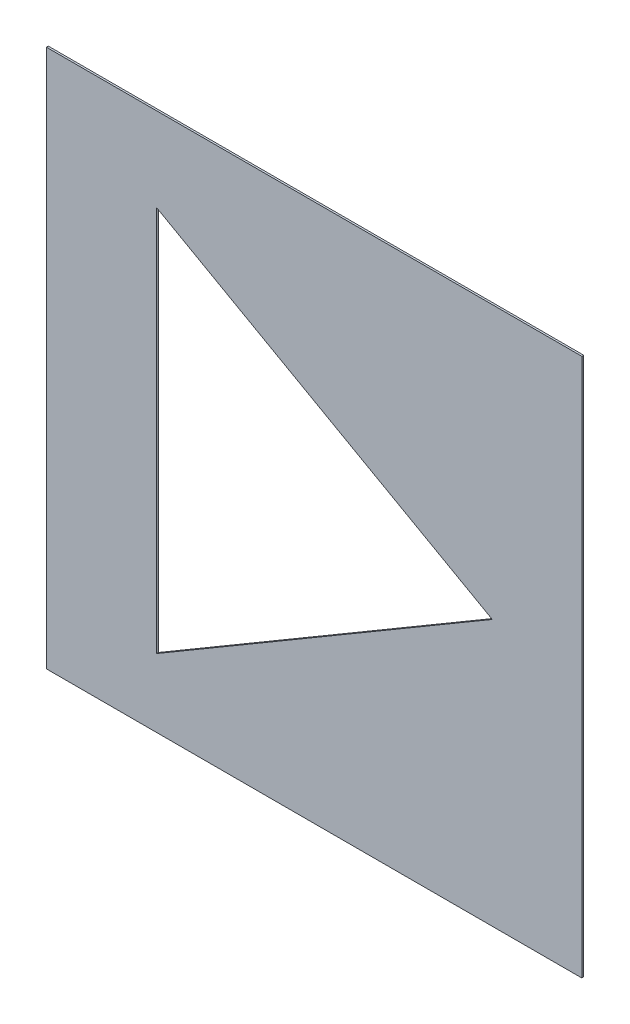
ISO-10303-21;
HEADER;
FILE_DESCRIPTION(('STEP AP214'),'2;1');
FILE_NAME('part.step','',(''),(''),'','','');
FILE_SCHEMA(('AUTOMOTIVE_DESIGN { 1 0 10303 214 1 1 1 1 }'));
ENDSEC;
DATA;
#1=APPLICATION_CONTEXT('core data for automotive mechanical design processes');
#2=APPLICATION_PROTOCOL_DEFINITION('international standard','automotive_design',2000,#1);
#3=PRODUCT_CONTEXT('',#1,'mechanical');
#4=PRODUCT('Part','Part','',(#3));
#5=PRODUCT_RELATED_PRODUCT_CATEGORY('part','',(#4));
#6=PRODUCT_DEFINITION_FORMATION('','',#4);
#7=PRODUCT_DEFINITION_CONTEXT('part definition',#1,'design');
#8=PRODUCT_DEFINITION('design','',#6,#7);
#9=PRODUCT_DEFINITION_SHAPE('','',#8);
#10=(LENGTH_UNIT() NAMED_UNIT(*) SI_UNIT(.MILLI.,.METRE.));
#11=(NAMED_UNIT(*) PLANE_ANGLE_UNIT() SI_UNIT($,.RADIAN.));
#12=(NAMED_UNIT(*) SI_UNIT($,.STERADIAN.) SOLID_ANGLE_UNIT());
#13=UNCERTAINTY_MEASURE_WITH_UNIT(LENGTH_MEASURE(1.E-05),#10,'distance_accuracy_value','');
#14=(GEOMETRIC_REPRESENTATION_CONTEXT(3) GLOBAL_UNCERTAINTY_ASSIGNED_CONTEXT((#13)) GLOBAL_UNIT_ASSIGNED_CONTEXT((#10,
#11,#12)) REPRESENTATION_CONTEXT('',''));
#15=CARTESIAN_POINT('',(0.,0.,0.));
#16=DIRECTION('',(0.,0.,1.));
#17=DIRECTION('',(1.,0.,0.));
#18=AXIS2_PLACEMENT_3D('',#15,#16,#17);
#19=CARTESIAN_POINT('',(-1.0634775795535,0.1814466251262,0.00086146168299));
#20=DIRECTION('',(0.,1.,0.));
#21=DIRECTION('',(0.,0.,1.));
#22=AXIS2_PLACEMENT_3D('',#19,#20,#21);
#23=PLANE('',#22);
#24=DIRECTION('',(0.,0.,1.));
#25=VECTOR('',#24,1.);
#26=CARTESIAN_POINT('',(-1.2323100649185,0.1814466251262,-0.00033853831701));
#27=LINE('',#26,#25);
#28=CARTESIAN_POINT('',(-1.2323100649185,0.1814466251262,-0.00033853831701));
#29=VERTEX_POINT('',#28);
#30=CARTESIAN_POINT('',(-1.2323100649185,0.1814466251262,0.00086146168299));
#31=VERTEX_POINT('',#30);
#32=EDGE_CURVE('E11',#29,#31,#27,.T.);
#33=ORIENTED_EDGE('',*,*,#32,.T.);
#34=DIRECTION('',(1.,0.,0.));
#35=VECTOR('',#34,1.);
#36=CARTESIAN_POINT('',(-1.2323100649185,0.1814466251262,0.00086146168299));
#37=LINE('',#36,#35);
#38=CARTESIAN_POINT('',(-0.8946450941885,0.1814466251262,0.00086146168299));
#39=VERTEX_POINT('',#38);
#40=EDGE_CURVE('E24',#31,#39,#37,.T.);
#41=ORIENTED_EDGE('',*,*,#40,.T.);
#42=DIRECTION('',(0.,0.,1.));
#43=VECTOR('',#42,1.);
#44=CARTESIAN_POINT('',(-0.8946450941885,0.1814466251262,-0.00033853831701));
#45=LINE('',#44,#43);
#46=CARTESIAN_POINT('',(-0.8946450941885,0.1814466251262,-0.00033853831701));
#47=VERTEX_POINT('',#46);
#48=EDGE_CURVE('E129',#47,#39,#45,.T.);
#49=ORIENTED_EDGE('',*,*,#48,.F.);
#50=DIRECTION('',(1.,0.,0.));
#51=VECTOR('',#50,1.);
#52=CARTESIAN_POINT('',(-1.2323100649185,0.1814466251262,-0.00033853831701));
#53=LINE('',#52,#51);
#54=EDGE_CURVE('E126',#29,#47,#53,.T.);
#55=ORIENTED_EDGE('',*,*,#54,.F.);
#56=EDGE_LOOP('',(#33,#41,#49,#55));
#57=FACE_BOUND('',#56,.T.);
#58=ADVANCED_FACE('F17',(#57),#23,.T.);
#59=CARTESIAN_POINT('',(-0.8946450941885,0.011705812303,0.00086146168299));
#60=DIRECTION('',(1.,0.,0.));
#61=DIRECTION('',(0.,0.,-1.));
#62=AXIS2_PLACEMENT_3D('',#59,#60,#61);
#63=PLANE('',#62);
#64=ORIENTED_EDGE('',*,*,#48,.T.);
#65=DIRECTION('',(0.,-1.,0.));
#66=VECTOR('',#65,1.);
#67=CARTESIAN_POINT('',(-0.8946450941885,0.1814466251262,0.00086146168299));
#68=LINE('',#67,#66);
#69=CARTESIAN_POINT('',(-0.8946450941885,-0.1580350005202,0.00086146168299));
#70=VERTEX_POINT('',#69);
#71=EDGE_CURVE('E124',#39,#70,#68,.T.);
#72=ORIENTED_EDGE('',*,*,#71,.T.);
#73=DIRECTION('',(0.,0.,1.));
#74=VECTOR('',#73,1.);
#75=CARTESIAN_POINT('',(-0.8946450941885,-0.1580350005202,-0.00033853831701));
#76=LINE('',#75,#74);
#77=CARTESIAN_POINT('',(-0.8946450941885,-0.1580350005202,-0.00033853831701));
#78=VERTEX_POINT('',#77);
#79=EDGE_CURVE('E121',#78,#70,#76,.T.);
#80=ORIENTED_EDGE('',*,*,#79,.F.);
#81=DIRECTION('',(0.,-1.,0.));
#82=VECTOR('',#81,1.);
#83=CARTESIAN_POINT('',(-0.8946450941885,0.1814466251262,-0.00033853831701));
#84=LINE('',#83,#82);
#85=EDGE_CURVE('E118',#47,#78,#84,.T.);
#86=ORIENTED_EDGE('',*,*,#85,.F.);
#87=EDGE_LOOP('',(#64,#72,#80,#86));
#88=FACE_BOUND('',#87,.T.);
#89=ADVANCED_FACE('F136',(#88),#63,.T.);
#90=CARTESIAN_POINT('',(-1.0634775795535,-0.1580350005202,0.00086146168299));
#91=DIRECTION('',(0.,-1.,0.));
#92=DIRECTION('',(0.,0.,-1.));
#93=AXIS2_PLACEMENT_3D('',#90,#91,#92);
#94=PLANE('',#93);
#95=ORIENTED_EDGE('',*,*,#79,.T.);
#96=DIRECTION('',(-1.,0.,0.));
#97=VECTOR('',#96,1.);
#98=CARTESIAN_POINT('',(-0.8946450941885,-0.1580350005202,0.00086146168299));
#99=LINE('',#98,#97);
#100=CARTESIAN_POINT('',(-1.2323100649185,-0.1580350005202,0.00086146168299));
#101=VERTEX_POINT('',#100);
#102=EDGE_CURVE('E116',#70,#101,#99,.T.);
#103=ORIENTED_EDGE('',*,*,#102,.T.);
#104=DIRECTION('',(0.,0.,1.));
#105=VECTOR('',#104,1.);
#106=CARTESIAN_POINT('',(-1.2323100649185,-0.1580350005202,-0.00033853831701));
#107=LINE('',#106,#105);
#108=CARTESIAN_POINT('',(-1.2323100649185,-0.1580350005202,-0.00033853831701));
#109=VERTEX_POINT('',#108);
#110=EDGE_CURVE('E113',#109,#101,#107,.T.);
#111=ORIENTED_EDGE('',*,*,#110,.F.);
#112=DIRECTION('',(-1.,0.,0.));
#113=VECTOR('',#112,1.);
#114=CARTESIAN_POINT('',(-0.8946450941885,-0.1580350005202,-0.00033853831701));
#115=LINE('',#114,#113);
#116=EDGE_CURVE('E110',#78,#109,#115,.T.);
#117=ORIENTED_EDGE('',*,*,#116,.F.);
#118=EDGE_LOOP('',(#95,#103,#111,#117));
#119=FACE_BOUND('',#118,.T.);
#120=ADVANCED_FACE('F141',(#119),#94,.T.);
#121=CARTESIAN_POINT('',(-1.2323100649185,0.011705812303,0.00086146168299));
#122=DIRECTION('',(-1.,0.,0.));
#123=DIRECTION('',(0.,0.,1.));
#124=AXIS2_PLACEMENT_3D('',#121,#122,#123);
#125=PLANE('',#124);
#126=ORIENTED_EDGE('',*,*,#110,.T.);
#127=DIRECTION('',(0.,1.,0.));
#128=VECTOR('',#127,1.);
#129=CARTESIAN_POINT('',(-1.2323100649185,-0.1580350005202,0.00086146168299));
#130=LINE('',#129,#128);
#131=EDGE_CURVE('E108',#101,#31,#130,.T.);
#132=ORIENTED_EDGE('',*,*,#131,.T.);
#133=ORIENTED_EDGE('',*,*,#32,.F.);
#134=DIRECTION('',(0.,1.,0.));
#135=VECTOR('',#134,1.);
#136=CARTESIAN_POINT('',(-1.2323100649185,-0.1580350005202,-0.00033853831701));
#137=LINE('',#136,#135);
#138=EDGE_CURVE('E105',#109,#29,#137,.T.);
#139=ORIENTED_EDGE('',*,*,#138,.F.);
#140=EDGE_LOOP('',(#126,#132,#133,#139));
#141=FACE_BOUND('',#140,.T.);
#142=ADVANCED_FACE('F143',(#141),#125,.T.);
#143=CARTESIAN_POINT('',(-1.1628156233065,0.0068178138476,0.00086146168299));
#144=DIRECTION('',(1.,0.,0.));
#145=DIRECTION('',(0.,0.,-1.));
#146=AXIS2_PLACEMENT_3D('',#143,#144,#145);
#147=PLANE('',#146);
#148=DIRECTION('',(0.,0.,1.));
#149=VECTOR('',#148,1.);
#150=CARTESIAN_POINT('',(-1.1628156233065,0.1286008991586,-0.00033853831701));
#151=LINE('',#150,#149);
#152=CARTESIAN_POINT('',(-1.1628156233065,0.1286008991586,-0.00033853831701));
#153=VERTEX_POINT('',#152);
#154=CARTESIAN_POINT('',(-1.1628156233065,0.1286008991586,0.00086146168299));
#155=VERTEX_POINT('',#154);
#156=EDGE_CURVE('E94',#153,#155,#151,.T.);
#157=ORIENTED_EDGE('',*,*,#156,.T.);
#158=DIRECTION('',(0.,-1.,0.));
#159=VECTOR('',#158,1.);
#160=CARTESIAN_POINT('',(-1.1628156233065,0.1286008991586,0.00086146168299));
#161=LINE('',#160,#159);
#162=CARTESIAN_POINT('',(-1.1628156233065,-0.1149652714634,0.00086146168299));
#163=VERTEX_POINT('',#162);
#164=EDGE_CURVE('E102',#155,#163,#161,.T.);
#165=ORIENTED_EDGE('',*,*,#164,.T.);
#166=DIRECTION('',(0.,0.,1.));
#167=VECTOR('',#166,1.);
#168=CARTESIAN_POINT('',(-1.1628156233065,-0.1149652714634,-0.00033853831701));
#169=LINE('',#168,#167);
#170=CARTESIAN_POINT('',(-1.1628156233065,-0.1149652714634,-0.00033853831701));
#171=VERTEX_POINT('',#170);
#172=EDGE_CURVE('E100',#171,#163,#169,.T.);
#173=ORIENTED_EDGE('',*,*,#172,.F.);
#174=DIRECTION('',(0.,-1.,0.));
#175=VECTOR('',#174,1.);
#176=CARTESIAN_POINT('',(-1.1628156233065,0.1286008991586,-0.00033853831701));
#177=LINE('',#176,#175);
#178=EDGE_CURVE('E90',#153,#171,#177,.T.);
#179=ORIENTED_EDGE('',*,*,#178,.F.);
#180=EDGE_LOOP('',(#157,#165,#173,#179));
#181=FACE_BOUND('',#180,.T.);
#182=ADVANCED_FACE('F165',(#181),#147,.T.);
#183=CARTESIAN_POINT('',(-1.0569554702197,-0.0527185203085346,0.00086146168299));
#184=DIRECTION('',(-0.506875367812853,0.862019351003552,0.));
#185=DIRECTION('',(0.,0.,1.));
#186=AXIS2_PLACEMENT_3D('',#183,#184,#185);
#187=PLANE('',#186);
#188=ORIENTED_EDGE('',*,*,#172,.T.);
#189=DIRECTION('',(0.862019351003552,0.506875367812853,0.));
#190=VECTOR('',#189,1.);
#191=CARTESIAN_POINT('',(-1.1628156233065,-0.1149652714634,0.00086146168299));
#192=LINE('',#191,#190);
#193=CARTESIAN_POINT('',(-0.9510953171329,0.00952823084633079,0.00086146168299));
#194=VERTEX_POINT('',#193);
#195=EDGE_CURVE('E78',#163,#194,#192,.T.);
#196=ORIENTED_EDGE('',*,*,#195,.T.);
#197=DIRECTION('',(0.,0.,1.));
#198=VECTOR('',#197,1.);
#199=CARTESIAN_POINT('',(-0.9510953171329,0.00952823084633079,-0.00033853831701));
#200=LINE('',#199,#198);
#201=CARTESIAN_POINT('',(-0.9510953171329,0.00952823084633079,-0.00033853831701));
#202=VERTEX_POINT('',#201);
#203=EDGE_CURVE('E72',#202,#194,#200,.T.);
#204=ORIENTED_EDGE('',*,*,#203,.F.);
#205=DIRECTION('',(0.862019351003552,0.506875367812853,0.));
#206=VECTOR('',#205,1.);
#207=CARTESIAN_POINT('',(-1.1628156233065,-0.1149652714634,-0.00033853831701));
#208=LINE('',#207,#206);
#209=EDGE_CURVE('E76',#171,#202,#208,.T.);
#210=ORIENTED_EDGE('',*,*,#209,.F.);
#211=EDGE_LOOP('',(#188,#196,#204,#210));
#212=FACE_BOUND('',#211,.T.);
#213=ADVANCED_FACE('F75',(#212),#187,.T.);
#214=CARTESIAN_POINT('',(-1.0569554702197,0.0690645650024654,0.00086146168299));
#215=DIRECTION('',(-0.490198680058478,-0.871610723929511,0.));
#216=DIRECTION('',(0.,0.,-1.));
#217=AXIS2_PLACEMENT_3D('',#214,#215,#216);
#218=PLANE('',#217);
#219=ORIENTED_EDGE('',*,*,#203,.T.);
#220=DIRECTION('',(-0.871610723929511,0.490198680058478,0.));
#221=VECTOR('',#220,1.);
#222=CARTESIAN_POINT('',(-0.9510953171329,0.00952823084633079,0.00086146168299));
#223=LINE('',#222,#221);
#224=EDGE_CURVE('E91',#194,#155,#223,.T.);
#225=ORIENTED_EDGE('',*,*,#224,.T.);
#226=ORIENTED_EDGE('',*,*,#156,.F.);
#227=DIRECTION('',(-0.871610723929511,0.490198680058478,0.));
#228=VECTOR('',#227,1.);
#229=CARTESIAN_POINT('',(-0.9510953171329,0.00952823084633079,-0.00033853831701));
#230=LINE('',#229,#228);
#231=EDGE_CURVE('E88',#202,#153,#230,.T.);
#232=ORIENTED_EDGE('',*,*,#231,.F.);
#233=EDGE_LOOP('',(#219,#225,#226,#232));
#234=FACE_BOUND('',#233,.T.);
#235=ADVANCED_FACE('F93',(#234),#218,.T.);
#236=CARTESIAN_POINT('',(-1.0634775795535,-0.1580350005202,-0.00033853831701));
#237=DIRECTION('',(0.,0.,1.));
#238=DIRECTION('',(1.,0.,0.));
#239=AXIS2_PLACEMENT_3D('',#236,#237,#238);
#240=PLANE('',#239);
#241=ORIENTED_EDGE('',*,*,#54,.T.);
#242=ORIENTED_EDGE('',*,*,#85,.T.);
#243=ORIENTED_EDGE('',*,*,#116,.T.);
#244=ORIENTED_EDGE('',*,*,#138,.T.);
#245=EDGE_LOOP('',(#241,#242,#243,#244));
#246=FACE_BOUND('',#245,.T.);
#247=ORIENTED_EDGE('',*,*,#178,.T.);
#248=ORIENTED_EDGE('',*,*,#209,.T.);
#249=ORIENTED_EDGE('',*,*,#231,.T.);
#250=EDGE_LOOP('',(#247,#248,#249));
#251=FACE_BOUND('',#250,.T.);
#252=ADVANCED_FACE('F87',(#246,#251),#240,.F.);
#253=CARTESIAN_POINT('',(-1.0634775795535,-0.1580350005202,0.00086146168299));
#254=DIRECTION('',(0.,0.,1.));
#255=DIRECTION('',(1.,0.,0.));
#256=AXIS2_PLACEMENT_3D('',#253,#254,#255);
#257=PLANE('',#256);
#258=ORIENTED_EDGE('',*,*,#40,.F.);
#259=ORIENTED_EDGE('',*,*,#131,.F.);
#260=ORIENTED_EDGE('',*,*,#102,.F.);
#261=ORIENTED_EDGE('',*,*,#71,.F.);
#262=EDGE_LOOP('',(#258,#259,#260,#261));
#263=FACE_BOUND('',#262,.T.);
#264=ORIENTED_EDGE('',*,*,#164,.F.);
#265=ORIENTED_EDGE('',*,*,#224,.F.);
#266=ORIENTED_EDGE('',*,*,#195,.F.);
#267=EDGE_LOOP('',(#264,#265,#266));
#268=FACE_BOUND('',#267,.T.);
#269=ADVANCED_FACE('F138',(#263,#268),#257,.T.);
#270=CLOSED_SHELL('',(#58,#89,#120,#142,#182,#213,#235,#252,#269));
#271=MANIFOLD_SOLID_BREP('B1',#270);
#272=ADVANCED_BREP_SHAPE_REPRESENTATION('',(#18,#271),#14);
#273=SHAPE_DEFINITION_REPRESENTATION(#9,#272);
ENDSEC;
END-ISO-10303-21;
